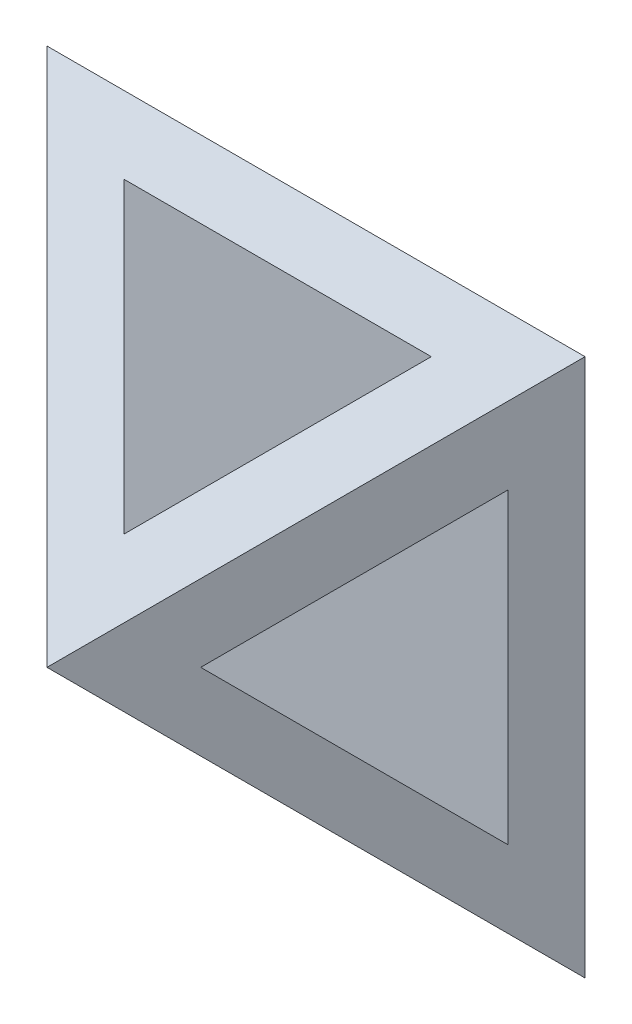
ISO-10303-21;
HEADER;
FILE_DESCRIPTION(('STEP AP214'),'2;1');
FILE_NAME('part.step','',(''),(''),'','','');
FILE_SCHEMA(('AUTOMOTIVE_DESIGN { 1 0 10303 214 1 1 1 1 }'));
ENDSEC;
DATA;
#1=APPLICATION_CONTEXT('core data for automotive mechanical design processes');
#2=APPLICATION_PROTOCOL_DEFINITION('international standard','automotive_design',2000,#1);
#3=PRODUCT_CONTEXT('',#1,'mechanical');
#4=PRODUCT('Part','Part','',(#3));
#5=PRODUCT_RELATED_PRODUCT_CATEGORY('part','',(#4));
#6=PRODUCT_DEFINITION_FORMATION('','',#4);
#7=PRODUCT_DEFINITION_CONTEXT('part definition',#1,'design');
#8=PRODUCT_DEFINITION('design','',#6,#7);
#9=PRODUCT_DEFINITION_SHAPE('','',#8);
#10=(LENGTH_UNIT() NAMED_UNIT(*) SI_UNIT(.MILLI.,.METRE.));
#11=(NAMED_UNIT(*) PLANE_ANGLE_UNIT() SI_UNIT($,.RADIAN.));
#12=(NAMED_UNIT(*) SI_UNIT($,.STERADIAN.) SOLID_ANGLE_UNIT());
#13=UNCERTAINTY_MEASURE_WITH_UNIT(LENGTH_MEASURE(1.E-05),#10,'distance_accuracy_value','');
#14=(GEOMETRIC_REPRESENTATION_CONTEXT(3) GLOBAL_UNCERTAINTY_ASSIGNED_CONTEXT((#13)) GLOBAL_UNIT_ASSIGNED_CONTEXT((#10,
#11,#12)) REPRESENTATION_CONTEXT('',''));
#15=CARTESIAN_POINT('',(0.,0.,0.));
#16=DIRECTION('',(0.,0.,1.));
#17=DIRECTION('',(1.,0.,0.));
#18=AXIS2_PLACEMENT_3D('',#15,#16,#17);
#19=CARTESIAN_POINT('',(-7.,7.,0.));
#20=DIRECTION('',(-0.707106781186546,0.,0.707106781186549));
#21=DIRECTION('',(0.707106781186549,0.,0.707106781186546));
#22=AXIS2_PLACEMENT_3D('',#19,#20,#21);
#23=PLANE('',#22);
#24=DIRECTION('',(0.,-1.,0.));
#25=VECTOR('',#24,1.);
#26=CARTESIAN_POINT('',(-7.,7.,0.));
#27=LINE('',#26,#25);
#28=CARTESIAN_POINT('',(-7.,7.,0.));
#29=VERTEX_POINT('',#28);
#30=CARTESIAN_POINT('',(-7.,-7.,0.));
#31=VERTEX_POINT('',#30);
#32=EDGE_CURVE('E161',#29,#31,#27,.T.);
#33=ORIENTED_EDGE('',*,*,#32,.T.);
#34=DIRECTION('',(-0.577350269189626,-0.577350269189627,-0.577350269189624));
#35=VECTOR('',#34,1.);
#36=CARTESIAN_POINT('',(-7.,-7.,0.));
#37=LINE('',#36,#35);
#38=CARTESIAN_POINT('',(0.,0.,6.99999999999998));
#39=VERTEX_POINT('',#38);
#40=EDGE_CURVE('E174',#39,#31,#37,.T.);
#41=ORIENTED_EDGE('',*,*,#40,.F.);
#42=DIRECTION('',(-0.577350269189626,0.577350269189627,-0.577350269189624));
#43=VECTOR('',#42,1.);
#44=CARTESIAN_POINT('',(-7.,7.,0.));
#45=LINE('',#44,#43);
#46=EDGE_CURVE('E173',#39,#29,#45,.T.);
#47=ORIENTED_EDGE('',*,*,#46,.T.);
#48=EDGE_LOOP('',(#33,#41,#47));
#49=FACE_BOUND('',#48,.T.);
#50=DIRECTION('',(0.,1.,0.));
#51=VECTOR('',#50,1.);
#52=CARTESIAN_POINT('',(-6.,7.,1.));
#53=LINE('',#52,#51);
#54=CARTESIAN_POINT('',(-5.99999999999999,3.99999999999997,1.));
#55=VERTEX_POINT('',#54);
#56=CARTESIAN_POINT('',(-6.,-4.00000000000002,1.));
#57=VERTEX_POINT('',#56);
#58=EDGE_CURVE('E133',#55,#57,#53,.F.);
#59=ORIENTED_EDGE('',*,*,#58,.F.);
#60=DIRECTION('',(0.577350269189627,-0.577350269189626,0.577350269189625));
#61=VECTOR('',#60,1.);
#62=CARTESIAN_POINT('',(-7.66666666666668,5.66666666666665,-0.666666666666675));
#63=LINE('',#62,#61);
#64=CARTESIAN_POINT('',(-2.00000000000001,0.,4.99999999999997));
#65=VERTEX_POINT('',#64);
#66=EDGE_CURVE('E128',#65,#55,#63,.F.);
#67=ORIENTED_EDGE('',*,*,#66,.F.);
#68=DIRECTION('',(-0.577350269189626,-0.577350269189629,-0.577350269189623));
#69=VECTOR('',#68,1.);
#70=CARTESIAN_POINT('',(-2.99999999999998,-0.999999999999978,4.00000000000001));
#71=LINE('',#70,#69);
#72=EDGE_CURVE('E115',#57,#65,#71,.F.);
#73=ORIENTED_EDGE('',*,*,#72,.F.);
#74=EDGE_LOOP('',(#59,#67,#73));
#75=FACE_BOUND('',#74,.T.);
#76=ADVANCED_FACE('F33',(#49,#75),#23,.T.);
#77=CARTESIAN_POINT('',(7.,7.,0.));
#78=DIRECTION('',(0.707106781186546,0.,0.707106781186549));
#79=DIRECTION('',(0.707106781186549,0.,-0.707106781186546));
#80=AXIS2_PLACEMENT_3D('',#77,#78,#79);
#81=PLANE('',#80);
#82=DIRECTION('',(0.,1.,0.));
#83=VECTOR('',#82,1.);
#84=CARTESIAN_POINT('',(7.,7.,0.));
#85=LINE('',#84,#83);
#86=CARTESIAN_POINT('',(7.,-7.,0.));
#87=VERTEX_POINT('',#86);
#88=CARTESIAN_POINT('',(7.,7.,0.));
#89=VERTEX_POINT('',#88);
#90=EDGE_CURVE('E167',#87,#89,#85,.T.);
#91=ORIENTED_EDGE('',*,*,#90,.T.);
#92=DIRECTION('',(0.577350269189626,0.577350269189627,-0.577350269189624));
#93=VECTOR('',#92,1.);
#94=CARTESIAN_POINT('',(2.33333333333332,2.33333333333332,4.66666666666666));
#95=LINE('',#94,#93);
#96=EDGE_CURVE('E180',#39,#89,#95,.T.);
#97=ORIENTED_EDGE('',*,*,#96,.F.);
#98=DIRECTION('',(0.577350269189626,-0.577350269189627,-0.577350269189624));
#99=VECTOR('',#98,1.);
#100=CARTESIAN_POINT('',(2.33333333333332,-2.33333333333332,4.66666666666666));
#101=LINE('',#100,#99);
#102=EDGE_CURVE('E178',#39,#87,#101,.T.);
#103=ORIENTED_EDGE('',*,*,#102,.T.);
#104=EDGE_LOOP('',(#91,#97,#103));
#105=FACE_BOUND('',#104,.T.);
#106=DIRECTION('',(0.,-1.,0.));
#107=VECTOR('',#106,1.);
#108=CARTESIAN_POINT('',(6.,7.,1.));
#109=LINE('',#108,#107);
#110=CARTESIAN_POINT('',(6.,-3.99999999999997,0.999999999999999));
#111=VERTEX_POINT('',#110);
#112=CARTESIAN_POINT('',(5.99999999999999,4.00000000000001,1.));
#113=VERTEX_POINT('',#112);
#114=EDGE_CURVE('E134',#111,#113,#109,.F.);
#115=ORIENTED_EDGE('',*,*,#114,.F.);
#116=DIRECTION('',(-0.577350269189627,0.577350269189626,0.577350269189625));
#117=VECTOR('',#116,1.);
#118=CARTESIAN_POINT('',(3.,-0.999999999999983,3.99999999999998));
#119=LINE('',#118,#117);
#120=CARTESIAN_POINT('',(2.00000000000001,0.,4.99999999999997));
#121=VERTEX_POINT('',#120);
#122=EDGE_CURVE('E124',#121,#111,#119,.F.);
#123=ORIENTED_EDGE('',*,*,#122,.F.);
#124=DIRECTION('',(0.577350269189626,0.577350269189628,-0.577350269189624));
#125=VECTOR('',#124,1.);
#126=CARTESIAN_POINT('',(7.66666666666666,5.66666666666669,-0.666666666666659));
#127=LINE('',#126,#125);
#128=EDGE_CURVE('E135',#113,#121,#127,.F.);
#129=ORIENTED_EDGE('',*,*,#128,.F.);
#130=EDGE_LOOP('',(#115,#123,#129));
#131=FACE_BOUND('',#130,.T.);
#132=ADVANCED_FACE('F228',(#105,#131),#81,.T.);
#133=CARTESIAN_POINT('',(2.49999999999999,-7.,2.5));
#134=DIRECTION('',(-0.707106781186546,0.,-0.707106781186549));
#135=DIRECTION('',(-0.707106781186549,0.,0.707106781186546));
#136=AXIS2_PLACEMENT_3D('',#133,#134,#135);
#137=PLANE('',#136);
#138=DIRECTION('',(0.,1.,0.));
#139=VECTOR('',#138,1.);
#140=CARTESIAN_POINT('',(3.99999999999999,-7.,1.));
#141=LINE('',#140,#139);
#142=CARTESIAN_POINT('',(3.99999999999999,4.00000000000001,1.));
#143=VERTEX_POINT('',#142);
#144=CARTESIAN_POINT('',(3.99999999999999,5.99999999999999,1.));
#145=VERTEX_POINT('',#144);
#146=EDGE_CURVE('E147',#143,#145,#141,.T.);
#147=ORIENTED_EDGE('',*,*,#146,.F.);
#148=DIRECTION('',(-0.577350269189626,-0.577350269189628,0.577350269189623));
#149=VECTOR('',#148,1.);
#150=CARTESIAN_POINT('',(-0.666666666666692,-0.666666666666696,5.66666666666666));
#151=LINE('',#150,#149);
#152=CARTESIAN_POINT('',(0.,0.,4.99999999999997));
#153=VERTEX_POINT('',#152);
#154=EDGE_CURVE('E123',#143,#153,#151,.T.);
#155=ORIENTED_EDGE('',*,*,#154,.T.);
#156=DIRECTION('',(0.,1.,0.));
#157=VECTOR('',#156,1.);
#158=CARTESIAN_POINT('',(0.,-7.,4.99999999999997));
#159=LINE('',#158,#157);
#160=CARTESIAN_POINT('',(0.,2.00000000000001,4.99999999999997));
#161=VERTEX_POINT('',#160);
#162=EDGE_CURVE('E151',#153,#161,#159,.T.);
#163=ORIENTED_EDGE('',*,*,#162,.T.);
#164=DIRECTION('',(-0.577350269189627,-0.577350269189626,0.577350269189624));
#165=VECTOR('',#164,1.);
#166=CARTESIAN_POINT('',(0.999999999999987,2.99999999999999,4.));
#167=LINE('',#166,#165);
#168=EDGE_CURVE('E185',#161,#145,#167,.F.);
#169=ORIENTED_EDGE('',*,*,#168,.T.);
#170=EDGE_LOOP('',(#147,#155,#163,#169));
#171=FACE_BOUND('',#170,.T.);
#172=ADVANCED_FACE('F209',(#171),#137,.T.);
#173=CARTESIAN_POINT('',(0.,-2.00000000000001,4.99999999999997));
#174=VERTEX_POINT('',#173);
#175=EDGE_CURVE('E148',#174,#153,#159,.T.);
#176=ORIENTED_EDGE('',*,*,#175,.T.);
#177=DIRECTION('',(0.577350269189627,-0.577350269189626,-0.577350269189624));
#178=VECTOR('',#177,1.);
#179=CARTESIAN_POINT('',(4.,-3.99999999999999,0.999999999999995));
#180=LINE('',#179,#178);
#181=CARTESIAN_POINT('',(3.99999999999999,-3.99999999999998,1.));
#182=VERTEX_POINT('',#181);
#183=EDGE_CURVE('E198',#153,#182,#180,.T.);
#184=ORIENTED_EDGE('',*,*,#183,.T.);
#185=CARTESIAN_POINT('',(3.99999999999999,-6.,1.));
#186=VERTEX_POINT('',#185);
#187=EDGE_CURVE('E143',#186,#182,#141,.T.);
#188=ORIENTED_EDGE('',*,*,#187,.F.);
#189=DIRECTION('',(0.577350269189627,-0.577350269189626,-0.577350269189624));
#190=VECTOR('',#189,1.);
#191=CARTESIAN_POINT('',(0.999999999999987,-2.99999999999999,4.));
#192=LINE('',#191,#190);
#193=EDGE_CURVE('E156',#186,#174,#192,.F.);
#194=ORIENTED_EDGE('',*,*,#193,.T.);
#195=EDGE_LOOP('',(#176,#184,#188,#194));
#196=FACE_BOUND('',#195,.T.);
#197=ADVANCED_FACE('F196',(#196),#137,.T.);
#198=CARTESIAN_POINT('',(-2.49999999999999,-7.,2.5));
#199=DIRECTION('',(0.707106781186546,0.,-0.707106781186549));
#200=DIRECTION('',(-0.707106781186549,0.,-0.707106781186546));
#201=AXIS2_PLACEMENT_3D('',#198,#199,#200);
#202=PLANE('',#201);
#203=ORIENTED_EDGE('',*,*,#162,.F.);
#204=DIRECTION('',(-0.577350269189628,0.577350269189625,-0.577350269189625));
#205=VECTOR('',#204,1.);
#206=CARTESIAN_POINT('',(0.666666666666679,-0.666666666666677,5.66666666666665));
#207=LINE('',#206,#205);
#208=CARTESIAN_POINT('',(-3.99999999999999,3.99999999999998,1.));
#209=VERTEX_POINT('',#208);
#210=EDGE_CURVE('E11',#153,#209,#207,.T.);
#211=ORIENTED_EDGE('',*,*,#210,.T.);
#212=DIRECTION('',(0.,1.,0.));
#213=VECTOR('',#212,1.);
#214=CARTESIAN_POINT('',(-3.99999999999999,-7.,1.));
#215=LINE('',#214,#213);
#216=CARTESIAN_POINT('',(-3.99999999999999,6.,1.));
#217=VERTEX_POINT('',#216);
#218=EDGE_CURVE('E142',#209,#217,#215,.T.);
#219=ORIENTED_EDGE('',*,*,#218,.T.);
#220=DIRECTION('',(-0.577350269189627,0.577350269189626,-0.577350269189624));
#221=VECTOR('',#220,1.);
#222=CARTESIAN_POINT('',(-5.66666666666667,7.66666666666667,-0.666666666666666));
#223=LINE('',#222,#221);
#224=EDGE_CURVE('E177',#217,#161,#223,.F.);
#225=ORIENTED_EDGE('',*,*,#224,.T.);
#226=EDGE_LOOP('',(#203,#211,#219,#225));
#227=FACE_BOUND('',#226,.T.);
#228=ADVANCED_FACE('F203',(#227),#202,.T.);
#229=CARTESIAN_POINT('',(-3.99999999999999,-6.,1.));
#230=VERTEX_POINT('',#229);
#231=CARTESIAN_POINT('',(-4.,-4.00000000000001,0.999999999999999));
#232=VERTEX_POINT('',#231);
#233=EDGE_CURVE('E152',#230,#232,#215,.T.);
#234=ORIENTED_EDGE('',*,*,#233,.T.);
#235=DIRECTION('',(0.577350269189626,0.577350269189628,0.577350269189623));
#236=VECTOR('',#235,1.);
#237=CARTESIAN_POINT('',(-4.,-4.00000000000001,0.999999999999999));
#238=LINE('',#237,#236);
#239=EDGE_CURVE('E41',#232,#153,#238,.T.);
#240=ORIENTED_EDGE('',*,*,#239,.T.);
#241=ORIENTED_EDGE('',*,*,#175,.F.);
#242=DIRECTION('',(0.577350269189627,0.577350269189626,0.577350269189624));
#243=VECTOR('',#242,1.);
#244=CARTESIAN_POINT('',(-5.66666666666667,-7.66666666666667,-0.666666666666666));
#245=LINE('',#244,#243);
#246=EDGE_CURVE('E146',#174,#230,#245,.F.);
#247=ORIENTED_EDGE('',*,*,#246,.T.);
#248=EDGE_LOOP('',(#234,#240,#241,#247));
#249=FACE_BOUND('',#248,.T.);
#250=ADVANCED_FACE('F191',(#249),#202,.T.);
#251=CARTESIAN_POINT('',(-7.,-7.,0.));
#252=DIRECTION('',(0.,-0.707106781186546,0.707106781186549));
#253=DIRECTION('',(0.,-0.707106781186549,-0.707106781186546));
#254=AXIS2_PLACEMENT_3D('',#251,#252,#253);
#255=PLANE('',#254);
#256=DIRECTION('',(1.,0.,0.));
#257=VECTOR('',#256,1.);
#258=CARTESIAN_POINT('',(-7.,-7.,0.));
#259=LINE('',#258,#257);
#260=EDGE_CURVE('E164',#31,#87,#259,.T.);
#261=ORIENTED_EDGE('',*,*,#260,.T.);
#262=ORIENTED_EDGE('',*,*,#102,.F.);
#263=ORIENTED_EDGE('',*,*,#40,.T.);
#264=EDGE_LOOP('',(#261,#262,#263));
#265=FACE_BOUND('',#264,.T.);
#266=DIRECTION('',(-1.,0.,0.));
#267=VECTOR('',#266,1.);
#268=CARTESIAN_POINT('',(-7.,-6.,1.));
#269=LINE('',#268,#267);
#270=EDGE_CURVE('E159',#230,#186,#269,.F.);
#271=ORIENTED_EDGE('',*,*,#270,.F.);
#272=ORIENTED_EDGE('',*,*,#246,.F.);
#273=ORIENTED_EDGE('',*,*,#193,.F.);
#274=EDGE_LOOP('',(#271,#272,#273));
#275=FACE_BOUND('',#274,.T.);
#276=ADVANCED_FACE('F35',(#265,#275),#255,.T.);
#277=CARTESIAN_POINT('',(-7.,7.,0.));
#278=DIRECTION('',(0.,0.707106781186546,0.707106781186549));
#279=DIRECTION('',(0.,-0.707106781186549,0.707106781186546));
#280=AXIS2_PLACEMENT_3D('',#277,#278,#279);
#281=PLANE('',#280);
#282=DIRECTION('',(-1.,0.,0.));
#283=VECTOR('',#282,1.);
#284=CARTESIAN_POINT('',(-7.,7.,0.));
#285=LINE('',#284,#283);
#286=EDGE_CURVE('E170',#89,#29,#285,.T.);
#287=ORIENTED_EDGE('',*,*,#286,.T.);
#288=ORIENTED_EDGE('',*,*,#46,.F.);
#289=ORIENTED_EDGE('',*,*,#96,.T.);
#290=EDGE_LOOP('',(#287,#288,#289));
#291=FACE_BOUND('',#290,.T.);
#292=DIRECTION('',(1.,0.,0.));
#293=VECTOR('',#292,1.);
#294=CARTESIAN_POINT('',(-7.,6.,1.));
#295=LINE('',#294,#293);
#296=EDGE_CURVE('E188',#145,#217,#295,.F.);
#297=ORIENTED_EDGE('',*,*,#296,.F.);
#298=ORIENTED_EDGE('',*,*,#168,.F.);
#299=ORIENTED_EDGE('',*,*,#224,.F.);
#300=EDGE_LOOP('',(#297,#298,#299));
#301=FACE_BOUND('',#300,.T.);
#302=ADVANCED_FACE('F239',(#291,#301),#281,.T.);
#303=CARTESIAN_POINT('',(0.,0.,0.));
#304=DIRECTION('',(0.,0.,1.));
#305=DIRECTION('',(1.,0.,0.));
#306=AXIS2_PLACEMENT_3D('',#303,#304,#305);
#307=PLANE('',#306);
#308=ORIENTED_EDGE('',*,*,#32,.F.);
#309=ORIENTED_EDGE('',*,*,#286,.F.);
#310=ORIENTED_EDGE('',*,*,#90,.F.);
#311=ORIENTED_EDGE('',*,*,#260,.F.);
#312=EDGE_LOOP('',(#308,#309,#310,#311));
#313=FACE_BOUND('',#312,.T.);
#314=ADVANCED_FACE('F241',(#313),#307,.F.);
#315=CARTESIAN_POINT('',(0.,-7.,1.));
#316=DIRECTION('',(0.,0.,1.));
#317=DIRECTION('',(1.,0.,0.));
#318=AXIS2_PLACEMENT_3D('',#315,#316,#317);
#319=PLANE('',#318);
#320=DIRECTION('',(-1.,0.,0.));
#321=VECTOR('',#320,1.);
#322=CARTESIAN_POINT('',(7.00000000000001,4.00000000000002,1.));
#323=LINE('',#322,#321);
#324=EDGE_CURVE('E216',#113,#143,#323,.T.);
#325=ORIENTED_EDGE('',*,*,#324,.T.);
#326=ORIENTED_EDGE('',*,*,#146,.T.);
#327=ORIENTED_EDGE('',*,*,#296,.T.);
#328=ORIENTED_EDGE('',*,*,#218,.F.);
#329=EDGE_CURVE('E218',#209,#55,#323,.T.);
#330=ORIENTED_EDGE('',*,*,#329,.T.);
#331=ORIENTED_EDGE('',*,*,#58,.T.);
#332=DIRECTION('',(-1.,0.,0.));
#333=VECTOR('',#332,1.);
#334=CARTESIAN_POINT('',(7.00000000000004,-3.99999999999997,1.));
#335=LINE('',#334,#333);
#336=EDGE_CURVE('E48',#232,#57,#335,.T.);
#337=ORIENTED_EDGE('',*,*,#336,.F.);
#338=ORIENTED_EDGE('',*,*,#233,.F.);
#339=ORIENTED_EDGE('',*,*,#270,.T.);
#340=ORIENTED_EDGE('',*,*,#187,.T.);
#341=EDGE_CURVE('E131',#111,#182,#335,.T.);
#342=ORIENTED_EDGE('',*,*,#341,.F.);
#343=ORIENTED_EDGE('',*,*,#114,.T.);
#344=EDGE_LOOP('',(#325,#326,#327,#328,#330,#331,#337,#338,#339,#340,#342,#343));
#345=FACE_BOUND('',#344,.T.);
#346=ADVANCED_FACE('F226',(#345),#319,.T.);
#347=CARTESIAN_POINT('',(7.00000000000003,-2.49999999999996,2.5));
#348=DIRECTION('',(0.,0.707106781186546,-0.707106781186549));
#349=DIRECTION('',(0.,0.707106781186549,0.707106781186546));
#350=AXIS2_PLACEMENT_3D('',#347,#348,#349);
#351=PLANE('',#350);
#352=ORIENTED_EDGE('',*,*,#72,.T.);
#353=DIRECTION('',(-1.,0.,0.));
#354=VECTOR('',#353,1.);
#355=CARTESIAN_POINT('',(7.00000000000002,0.,4.99999999999997));
#356=LINE('',#355,#354);
#357=EDGE_CURVE('E118',#153,#65,#356,.T.);
#358=ORIENTED_EDGE('',*,*,#357,.F.);
#359=ORIENTED_EDGE('',*,*,#239,.F.);
#360=ORIENTED_EDGE('',*,*,#336,.T.);
#361=EDGE_LOOP('',(#352,#358,#359,#360));
#362=FACE_BOUND('',#361,.T.);
#363=ADVANCED_FACE('F117',(#362),#351,.T.);
#364=CARTESIAN_POINT('',(7.00000000000002,2.50000000000001,2.5));
#365=DIRECTION('',(0.,-0.707106781186546,-0.707106781186549));
#366=DIRECTION('',(0.,0.707106781186549,-0.707106781186546));
#367=AXIS2_PLACEMENT_3D('',#364,#365,#366);
#368=PLANE('',#367);
#369=ORIENTED_EDGE('',*,*,#66,.T.);
#370=ORIENTED_EDGE('',*,*,#329,.F.);
#371=ORIENTED_EDGE('',*,*,#210,.F.);
#372=ORIENTED_EDGE('',*,*,#357,.T.);
#373=EDGE_LOOP('',(#369,#370,#371,#372));
#374=FACE_BOUND('',#373,.T.);
#375=ADVANCED_FACE('F127',(#374),#368,.T.);
#376=ORIENTED_EDGE('',*,*,#128,.T.);
#377=EDGE_CURVE('E56',#121,#153,#356,.T.);
#378=ORIENTED_EDGE('',*,*,#377,.T.);
#379=ORIENTED_EDGE('',*,*,#154,.F.);
#380=ORIENTED_EDGE('',*,*,#324,.F.);
#381=EDGE_LOOP('',(#376,#378,#379,#380));
#382=FACE_BOUND('',#381,.T.);
#383=ADVANCED_FACE('F220',(#382),#368,.T.);
#384=ORIENTED_EDGE('',*,*,#122,.T.);
#385=ORIENTED_EDGE('',*,*,#341,.T.);
#386=ORIENTED_EDGE('',*,*,#183,.F.);
#387=ORIENTED_EDGE('',*,*,#377,.F.);
#388=EDGE_LOOP('',(#384,#385,#386,#387));
#389=FACE_BOUND('',#388,.T.);
#390=ADVANCED_FACE('F223',(#389),#351,.T.);
#391=CLOSED_SHELL('',(#76,#132,#172,#197,#228,#250,#276,#302,#314,#346,#363,#375,#383,#390));
#392=MANIFOLD_SOLID_BREP('B2',#391);
#393=ADVANCED_BREP_SHAPE_REPRESENTATION('',(#18,#392),#14);
#394=SHAPE_DEFINITION_REPRESENTATION(#9,#393);
ENDSEC;
END-ISO-10303-21;
